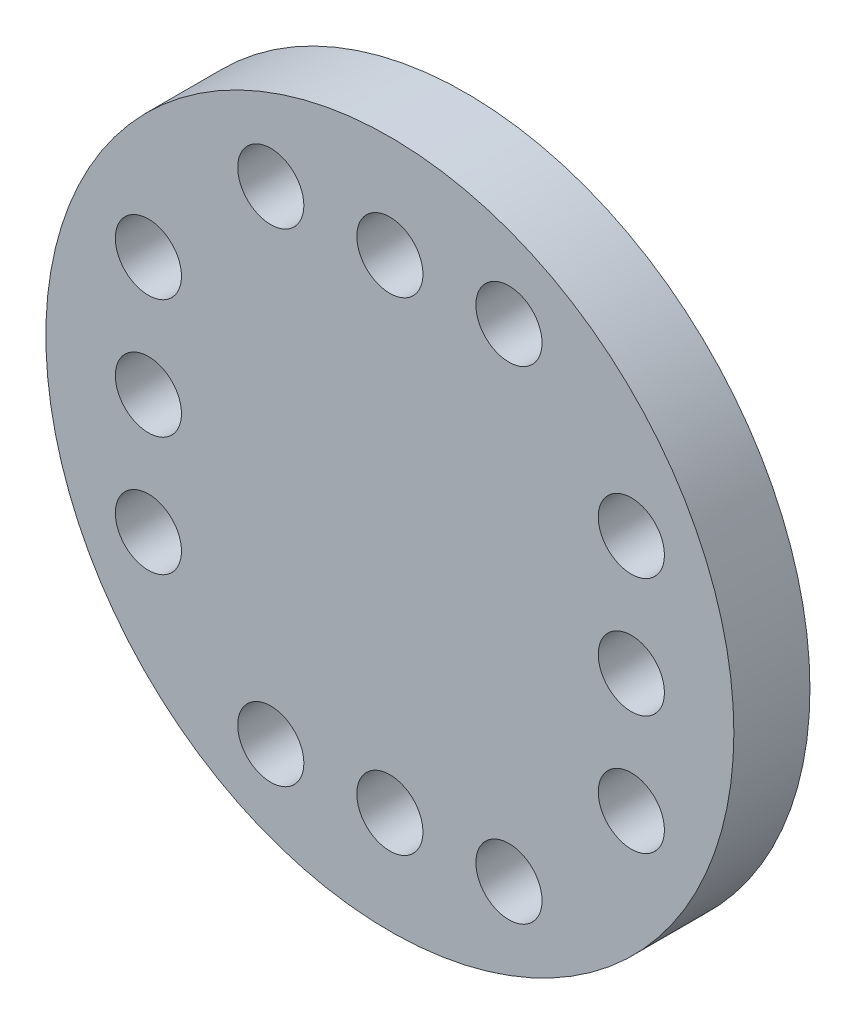
ISO-10303-21;
HEADER;
FILE_DESCRIPTION(('STEP AP214'),'2;1');
FILE_NAME('part.step','',(''),(''),'','','');
FILE_SCHEMA(('AUTOMOTIVE_DESIGN { 1 0 10303 214 1 1 1 1 }'));
ENDSEC;
DATA;
#1=APPLICATION_CONTEXT('core data for automotive mechanical design processes');
#2=APPLICATION_PROTOCOL_DEFINITION('international standard','automotive_design',2000,#1);
#3=PRODUCT_CONTEXT('',#1,'mechanical');
#4=PRODUCT('Part','Part','',(#3));
#5=PRODUCT_RELATED_PRODUCT_CATEGORY('part','',(#4));
#6=PRODUCT_DEFINITION_FORMATION('','',#4);
#7=PRODUCT_DEFINITION_CONTEXT('part definition',#1,'design');
#8=PRODUCT_DEFINITION('design','',#6,#7);
#9=PRODUCT_DEFINITION_SHAPE('','',#8);
#10=(LENGTH_UNIT() NAMED_UNIT(*) SI_UNIT(.MILLI.,.METRE.));
#11=(NAMED_UNIT(*) PLANE_ANGLE_UNIT() SI_UNIT($,.RADIAN.));
#12=(NAMED_UNIT(*) SI_UNIT($,.STERADIAN.) SOLID_ANGLE_UNIT());
#13=UNCERTAINTY_MEASURE_WITH_UNIT(LENGTH_MEASURE(1.E-05),#10,'distance_accuracy_value','');
#14=(GEOMETRIC_REPRESENTATION_CONTEXT(3) GLOBAL_UNCERTAINTY_ASSIGNED_CONTEXT((#13)) GLOBAL_UNIT_ASSIGNED_CONTEXT((#10,
#11,#12)) REPRESENTATION_CONTEXT('',''));
#15=CARTESIAN_POINT('',(0.,0.,0.));
#16=DIRECTION('',(0.,0.,1.));
#17=DIRECTION('',(1.,0.,0.));
#18=AXIS2_PLACEMENT_3D('',#15,#16,#17);
#19=CARTESIAN_POINT('',(10.45,0.,-3.));
#20=DIRECTION('',(0.,0.,1.));
#21=DIRECTION('',(1.,0.,0.));
#22=AXIS2_PLACEMENT_3D('',#19,#20,#21);
#23=PLANE('',#22);
#24=CARTESIAN_POINT('',(10.45,0.,-3.));
#25=DIRECTION('',(0.,0.,1.));
#26=DIRECTION('',(1.,0.,0.));
#27=AXIS2_PLACEMENT_3D('',#24,#25,#26);
#28=CIRCLE('',#27,4.4);
#29=CARTESIAN_POINT('',(14.85,0.,-3.));
#30=VERTEX_POINT('',#29);
#31=EDGE_CURVE('E34',#30,#30,#28,.T.);
#32=ORIENTED_EDGE('',*,*,#31,.F.);
#33=EDGE_LOOP('',(#32));
#34=FACE_BOUND('',#33,.T.);
#35=CARTESIAN_POINT('',(10.45,0.,-3.));
#36=DIRECTION('',(0.,0.,1.));
#37=DIRECTION('',(1.,0.,0.));
#38=AXIS2_PLACEMENT_3D('',#35,#36,#37);
#39=CIRCLE('',#38,2.95);
#40=CARTESIAN_POINT('',(13.4,0.,-3.));
#41=VERTEX_POINT('',#40);
#42=EDGE_CURVE('E41',#41,#41,#39,.T.);
#43=ORIENTED_EDGE('',*,*,#42,.T.);
#44=EDGE_LOOP('',(#43));
#45=FACE_BOUND('',#44,.T.);
#46=ADVANCED_FACE('F30',(#34,#45),#23,.F.);
#47=CARTESIAN_POINT('',(10.45,0.,0.));
#48=DIRECTION('',(0.,0.,-1.));
#49=DIRECTION('',(-1.,0.,0.));
#50=AXIS2_PLACEMENT_3D('',#47,#48,#49);
#51=CYLINDRICAL_SURFACE('',#50,4.4);
#52=CARTESIAN_POINT('',(10.45,0.,0.));
#53=DIRECTION('',(0.,0.,1.));
#54=DIRECTION('',(1.,0.,0.));
#55=AXIS2_PLACEMENT_3D('',#52,#53,#54);
#56=CIRCLE('',#55,4.4);
#57=CARTESIAN_POINT('',(14.85,0.,0.));
#58=VERTEX_POINT('',#57);
#59=EDGE_CURVE('E10',#58,#58,#56,.T.);
#60=ORIENTED_EDGE('',*,*,#59,.F.);
#61=EDGE_LOOP('',(#60));
#62=FACE_BOUND('',#61,.T.);
#63=ORIENTED_EDGE('',*,*,#31,.T.);
#64=EDGE_LOOP('',(#63));
#65=FACE_BOUND('',#64,.T.);
#66=ADVANCED_FACE('F32',(#62,#65),#51,.T.);
#67=CARTESIAN_POINT('',(10.45,0.,0.));
#68=DIRECTION('',(0.,0.,-1.));
#69=DIRECTION('',(-1.,0.,0.));
#70=AXIS2_PLACEMENT_3D('',#67,#68,#69);
#71=CYLINDRICAL_SURFACE('',#70,2.95);
#72=CARTESIAN_POINT('',(10.45,0.,0.));
#73=DIRECTION('',(0.,0.,1.));
#74=DIRECTION('',(1.,0.,0.));
#75=AXIS2_PLACEMENT_3D('',#72,#73,#74);
#76=CIRCLE('',#75,2.95);
#77=CARTESIAN_POINT('',(13.4,0.,0.));
#78=VERTEX_POINT('',#77);
#79=EDGE_CURVE('E45',#78,#78,#76,.T.);
#80=ORIENTED_EDGE('',*,*,#79,.T.);
#81=EDGE_LOOP('',(#80));
#82=FACE_BOUND('',#81,.T.);
#83=ORIENTED_EDGE('',*,*,#42,.F.);
#84=EDGE_LOOP('',(#83));
#85=FACE_BOUND('',#84,.T.);
#86=ADVANCED_FACE('F178',(#82,#85),#71,.F.);
#87=CARTESIAN_POINT('',(10.45,0.,0.));
#88=DIRECTION('',(0.,0.,1.));
#89=DIRECTION('',(1.,0.,0.));
#90=AXIS2_PLACEMENT_3D('',#87,#88,#89);
#91=PLANE('',#90);
#92=ORIENTED_EDGE('',*,*,#79,.F.);
#93=EDGE_LOOP('',(#92));
#94=FACE_BOUND('',#93,.T.);
#95=ADVANCED_FACE('F173',(#94),#91,.F.);
#96=CARTESIAN_POINT('',(17.75,3.60000000000019,0.));
#97=DIRECTION('',(0.,0.,1.));
#98=DIRECTION('',(1.,0.,0.));
#99=AXIS2_PLACEMENT_3D('',#96,#97,#98);
#100=CIRCLE('',#99,1.);
#101=CARTESIAN_POINT('',(18.75,3.60000000000019,0.));
#102=VERTEX_POINT('',#101);
#103=EDGE_CURVE('E118',#102,#102,#100,.T.);
#104=ORIENTED_EDGE('',*,*,#103,.T.);
#105=EDGE_LOOP('',(#104));
#106=FACE_BOUND('',#105,.T.);
#107=CARTESIAN_POINT('',(17.7500000000002,-3.59999999999981,0.));
#108=DIRECTION('',(0.,0.,1.));
#109=DIRECTION('',(1.,0.,0.));
#110=AXIS2_PLACEMENT_3D('',#107,#108,#109);
#111=CIRCLE('',#110,0.999999999999998);
#112=CARTESIAN_POINT('',(18.7500000000001,-3.59999999999981,0.));
#113=VERTEX_POINT('',#112);
#114=EDGE_CURVE('E112',#113,#113,#111,.T.);
#115=ORIENTED_EDGE('',*,*,#114,.T.);
#116=EDGE_LOOP('',(#115));
#117=FACE_BOUND('',#116,.T.);
#118=CARTESIAN_POINT('',(17.7500000000001,1.94289029309402E-13,0.));
#119=DIRECTION('',(0.,0.,1.));
#120=DIRECTION('',(1.,0.,0.));
#121=AXIS2_PLACEMENT_3D('',#118,#119,#120);
#122=CIRCLE('',#121,1.);
#123=CARTESIAN_POINT('',(18.7500000000001,1.94289029309402E-13,0.));
#124=VERTEX_POINT('',#123);
#125=EDGE_CURVE('E106',#124,#124,#122,.T.);
#126=ORIENTED_EDGE('',*,*,#125,.T.);
#127=EDGE_LOOP('',(#126));
#128=FACE_BOUND('',#127,.T.);
#129=CARTESIAN_POINT('',(14.0500000000003,-7.29999999999994,0.));
#130=DIRECTION('',(0.,0.,1.));
#131=DIRECTION('',(1.,0.,0.));
#132=AXIS2_PLACEMENT_3D('',#129,#130,#131);
#133=CIRCLE('',#132,1.);
#134=CARTESIAN_POINT('',(15.0500000000003,-7.29999999999994,0.));
#135=VERTEX_POINT('',#134);
#136=EDGE_CURVE('E100',#135,#135,#133,.T.);
#137=ORIENTED_EDGE('',*,*,#136,.T.);
#138=EDGE_LOOP('',(#137));
#139=FACE_BOUND('',#138,.T.);
#140=CARTESIAN_POINT('',(6.85000000000026,-7.30000000000001,0.));
#141=DIRECTION('',(0.,0.,1.));
#142=DIRECTION('',(1.,0.,0.));
#143=AXIS2_PLACEMENT_3D('',#140,#141,#142);
#144=CIRCLE('',#143,0.999999999999997);
#145=CARTESIAN_POINT('',(7.85000000000026,-7.30000000000001,0.));
#146=VERTEX_POINT('',#145);
#147=EDGE_CURVE('E94',#146,#146,#144,.T.);
#148=ORIENTED_EDGE('',*,*,#147,.T.);
#149=EDGE_LOOP('',(#148));
#150=FACE_BOUND('',#149,.T.);
#151=CARTESIAN_POINT('',(10.4500000000003,-7.29999999999999,0.));
#152=DIRECTION('',(0.,0.,1.));
#153=DIRECTION('',(1.,0.,0.));
#154=AXIS2_PLACEMENT_3D('',#151,#152,#153);
#155=CIRCLE('',#154,0.999999999999998);
#156=CARTESIAN_POINT('',(11.4500000000003,-7.29999999999999,0.));
#157=VERTEX_POINT('',#156);
#158=EDGE_CURVE('E88',#157,#157,#155,.T.);
#159=ORIENTED_EDGE('',*,*,#158,.T.);
#160=EDGE_LOOP('',(#159));
#161=FACE_BOUND('',#160,.T.);
#162=CARTESIAN_POINT('',(3.15000000000015,-3.60000000000011,0.));
#163=DIRECTION('',(0.,0.,1.));
#164=DIRECTION('',(1.,0.,0.));
#165=AXIS2_PLACEMENT_3D('',#162,#163,#164);
#166=CIRCLE('',#165,0.999999999999999);
#167=CARTESIAN_POINT('',(4.15000000000015,-3.60000000000011,0.));
#168=VERTEX_POINT('',#167);
#169=EDGE_CURVE('E82',#168,#168,#166,.T.);
#170=ORIENTED_EDGE('',*,*,#169,.T.);
#171=EDGE_LOOP('',(#170));
#172=FACE_BOUND('',#171,.T.);
#173=CARTESIAN_POINT('',(3.1500000000001,3.59999999999989,0.));
#174=DIRECTION('',(0.,0.,1.));
#175=DIRECTION('',(1.,0.,0.));
#176=AXIS2_PLACEMENT_3D('',#173,#174,#175);
#177=CIRCLE('',#176,0.999999999999999);
#178=CARTESIAN_POINT('',(4.1500000000001,3.59999999999989,0.));
#179=VERTEX_POINT('',#178);
#180=EDGE_CURVE('E76',#179,#179,#177,.T.);
#181=ORIENTED_EDGE('',*,*,#180,.T.);
#182=EDGE_LOOP('',(#181));
#183=FACE_BOUND('',#182,.T.);
#184=CARTESIAN_POINT('',(3.15000000000011,-1.14491749414469E-13,0.));
#185=DIRECTION('',(0.,0.,1.));
#186=DIRECTION('',(1.,0.,0.));
#187=AXIS2_PLACEMENT_3D('',#184,#185,#186);
#188=CIRCLE('',#187,1.);
#189=CARTESIAN_POINT('',(4.15000000000011,-1.14491749414469E-13,0.));
#190=VERTEX_POINT('',#189);
#191=EDGE_CURVE('E70',#190,#190,#188,.T.);
#192=ORIENTED_EDGE('',*,*,#191,.T.);
#193=EDGE_LOOP('',(#192));
#194=FACE_BOUND('',#193,.T.);
#195=CARTESIAN_POINT('',(6.85000000000001,7.29999999999999,0.));
#196=DIRECTION('',(0.,0.,1.));
#197=DIRECTION('',(1.,0.,0.));
#198=AXIS2_PLACEMENT_3D('',#195,#196,#197);
#199=CIRCLE('',#198,1.);
#200=CARTESIAN_POINT('',(7.85000000000001,7.29999999999999,0.));
#201=VERTEX_POINT('',#200);
#202=EDGE_CURVE('E64',#201,#201,#199,.T.);
#203=ORIENTED_EDGE('',*,*,#202,.T.);
#204=EDGE_LOOP('',(#203));
#205=FACE_BOUND('',#204,.T.);
#206=CARTESIAN_POINT('',(14.05,7.30000000000001,0.));
#207=DIRECTION('',(0.,0.,1.));
#208=DIRECTION('',(1.,0.,0.));
#209=AXIS2_PLACEMENT_3D('',#206,#207,#208);
#210=CIRCLE('',#209,0.999999999999998);
#211=CARTESIAN_POINT('',(15.05,7.30000000000001,0.));
#212=VERTEX_POINT('',#211);
#213=EDGE_CURVE('E58',#212,#212,#210,.T.);
#214=ORIENTED_EDGE('',*,*,#213,.T.);
#215=EDGE_LOOP('',(#214));
#216=FACE_BOUND('',#215,.T.);
#217=CARTESIAN_POINT('',(10.45,7.30000000000001,0.));
#218=DIRECTION('',(0.,0.,1.));
#219=DIRECTION('',(1.,0.,0.));
#220=AXIS2_PLACEMENT_3D('',#217,#218,#219);
#221=CIRCLE('',#220,1.);
#222=CARTESIAN_POINT('',(11.45,7.30000000000001,0.));
#223=VERTEX_POINT('',#222);
#224=EDGE_CURVE('E52',#223,#223,#221,.T.);
#225=ORIENTED_EDGE('',*,*,#224,.T.);
#226=EDGE_LOOP('',(#225));
#227=FACE_BOUND('',#226,.T.);
#228=CARTESIAN_POINT('',(10.45,0.,0.));
#229=DIRECTION('',(0.,0.,1.));
#230=DIRECTION('',(1.,0.,0.));
#231=AXIS2_PLACEMENT_3D('',#228,#229,#230);
#232=CIRCLE('',#231,10.4);
#233=CARTESIAN_POINT('',(20.85,0.,0.));
#234=VERTEX_POINT('',#233);
#235=EDGE_CURVE('E49',#234,#234,#232,.T.);
#236=ORIENTED_EDGE('',*,*,#235,.F.);
#237=EDGE_LOOP('',(#236));
#238=FACE_BOUND('',#237,.T.);
#239=ORIENTED_EDGE('',*,*,#59,.T.);
#240=EDGE_LOOP('',(#239));
#241=FACE_BOUND('',#240,.T.);
#242=ADVANCED_FACE('F127',(#106,#117,#128,#139,#150,#161,#172,#183,#194,#205,#216,#227,#238,
#241),#91,.F.);
#243=CARTESIAN_POINT('',(10.45,0.,2.3));
#244=DIRECTION('',(0.,0.,-1.));
#245=DIRECTION('',(-1.,0.,0.));
#246=AXIS2_PLACEMENT_3D('',#243,#244,#245);
#247=CYLINDRICAL_SURFACE('',#246,10.4);
#248=CARTESIAN_POINT('',(10.45,0.,2.3));
#249=DIRECTION('',(0.,0.,1.));
#250=DIRECTION('',(1.,0.,0.));
#251=AXIS2_PLACEMENT_3D('',#248,#249,#250);
#252=CIRCLE('',#251,10.4);
#253=CARTESIAN_POINT('',(20.85,0.,2.3));
#254=VERTEX_POINT('',#253);
#255=EDGE_CURVE('E48',#254,#254,#252,.T.);
#256=ORIENTED_EDGE('',*,*,#255,.F.);
#257=EDGE_LOOP('',(#256));
#258=FACE_BOUND('',#257,.T.);
#259=ORIENTED_EDGE('',*,*,#235,.T.);
#260=EDGE_LOOP('',(#259));
#261=FACE_BOUND('',#260,.T.);
#262=ADVANCED_FACE('F141',(#258,#261),#247,.T.);
#263=CARTESIAN_POINT('',(10.45,0.,2.3));
#264=DIRECTION('',(0.,0.,1.));
#265=DIRECTION('',(1.,0.,0.));
#266=AXIS2_PLACEMENT_3D('',#263,#264,#265);
#267=PLANE('',#266);
#268=CARTESIAN_POINT('',(17.75,3.60000000000019,2.3));
#269=DIRECTION('',(0.,0.,1.));
#270=DIRECTION('',(1.,0.,0.));
#271=AXIS2_PLACEMENT_3D('',#268,#269,#270);
#272=CIRCLE('',#271,1.);
#273=CARTESIAN_POINT('',(18.75,3.60000000000019,2.3));
#274=VERTEX_POINT('',#273);
#275=EDGE_CURVE('E121',#274,#274,#272,.T.);
#276=ORIENTED_EDGE('',*,*,#275,.F.);
#277=EDGE_LOOP('',(#276));
#278=FACE_BOUND('',#277,.T.);
#279=CARTESIAN_POINT('',(17.7500000000002,-3.59999999999981,2.3));
#280=DIRECTION('',(0.,0.,1.));
#281=DIRECTION('',(1.,0.,0.));
#282=AXIS2_PLACEMENT_3D('',#279,#280,#281);
#283=CIRCLE('',#282,0.999999999999998);
#284=CARTESIAN_POINT('',(18.7500000000001,-3.59999999999981,2.3));
#285=VERTEX_POINT('',#284);
#286=EDGE_CURVE('E115',#285,#285,#283,.T.);
#287=ORIENTED_EDGE('',*,*,#286,.F.);
#288=EDGE_LOOP('',(#287));
#289=FACE_BOUND('',#288,.T.);
#290=CARTESIAN_POINT('',(17.7500000000001,1.94289029309402E-13,2.3));
#291=DIRECTION('',(0.,0.,1.));
#292=DIRECTION('',(1.,0.,0.));
#293=AXIS2_PLACEMENT_3D('',#290,#291,#292);
#294=CIRCLE('',#293,1.);
#295=CARTESIAN_POINT('',(18.7500000000001,1.94289029309402E-13,2.3));
#296=VERTEX_POINT('',#295);
#297=EDGE_CURVE('E109',#296,#296,#294,.T.);
#298=ORIENTED_EDGE('',*,*,#297,.F.);
#299=EDGE_LOOP('',(#298));
#300=FACE_BOUND('',#299,.T.);
#301=CARTESIAN_POINT('',(14.0500000000003,-7.29999999999994,2.3));
#302=DIRECTION('',(0.,0.,1.));
#303=DIRECTION('',(1.,0.,0.));
#304=AXIS2_PLACEMENT_3D('',#301,#302,#303);
#305=CIRCLE('',#304,1.);
#306=CARTESIAN_POINT('',(15.0500000000003,-7.29999999999994,2.3));
#307=VERTEX_POINT('',#306);
#308=EDGE_CURVE('E103',#307,#307,#305,.T.);
#309=ORIENTED_EDGE('',*,*,#308,.F.);
#310=EDGE_LOOP('',(#309));
#311=FACE_BOUND('',#310,.T.);
#312=CARTESIAN_POINT('',(6.85000000000026,-7.30000000000001,2.3));
#313=DIRECTION('',(0.,0.,1.));
#314=DIRECTION('',(1.,0.,0.));
#315=AXIS2_PLACEMENT_3D('',#312,#313,#314);
#316=CIRCLE('',#315,0.999999999999997);
#317=CARTESIAN_POINT('',(7.85000000000026,-7.30000000000001,2.3));
#318=VERTEX_POINT('',#317);
#319=EDGE_CURVE('E97',#318,#318,#316,.T.);
#320=ORIENTED_EDGE('',*,*,#319,.F.);
#321=EDGE_LOOP('',(#320));
#322=FACE_BOUND('',#321,.T.);
#323=CARTESIAN_POINT('',(10.4500000000003,-7.29999999999999,2.3));
#324=DIRECTION('',(0.,0.,1.));
#325=DIRECTION('',(1.,0.,0.));
#326=AXIS2_PLACEMENT_3D('',#323,#324,#325);
#327=CIRCLE('',#326,0.999999999999998);
#328=CARTESIAN_POINT('',(11.4500000000003,-7.29999999999999,2.3));
#329=VERTEX_POINT('',#328);
#330=EDGE_CURVE('E91',#329,#329,#327,.T.);
#331=ORIENTED_EDGE('',*,*,#330,.F.);
#332=EDGE_LOOP('',(#331));
#333=FACE_BOUND('',#332,.T.);
#334=CARTESIAN_POINT('',(3.15000000000015,-3.60000000000011,2.3));
#335=DIRECTION('',(0.,0.,1.));
#336=DIRECTION('',(1.,0.,0.));
#337=AXIS2_PLACEMENT_3D('',#334,#335,#336);
#338=CIRCLE('',#337,0.999999999999999);
#339=CARTESIAN_POINT('',(4.15000000000015,-3.60000000000011,2.3));
#340=VERTEX_POINT('',#339);
#341=EDGE_CURVE('E85',#340,#340,#338,.T.);
#342=ORIENTED_EDGE('',*,*,#341,.F.);
#343=EDGE_LOOP('',(#342));
#344=FACE_BOUND('',#343,.T.);
#345=CARTESIAN_POINT('',(3.1500000000001,3.59999999999989,2.3));
#346=DIRECTION('',(0.,0.,1.));
#347=DIRECTION('',(1.,0.,0.));
#348=AXIS2_PLACEMENT_3D('',#345,#346,#347);
#349=CIRCLE('',#348,0.999999999999999);
#350=CARTESIAN_POINT('',(4.1500000000001,3.59999999999989,2.3));
#351=VERTEX_POINT('',#350);
#352=EDGE_CURVE('E79',#351,#351,#349,.T.);
#353=ORIENTED_EDGE('',*,*,#352,.F.);
#354=EDGE_LOOP('',(#353));
#355=FACE_BOUND('',#354,.T.);
#356=CARTESIAN_POINT('',(3.15000000000011,-1.14491749414469E-13,2.3));
#357=DIRECTION('',(0.,0.,1.));
#358=DIRECTION('',(1.,0.,0.));
#359=AXIS2_PLACEMENT_3D('',#356,#357,#358);
#360=CIRCLE('',#359,1.);
#361=CARTESIAN_POINT('',(4.15000000000011,-1.14491749414469E-13,2.3));
#362=VERTEX_POINT('',#361);
#363=EDGE_CURVE('E73',#362,#362,#360,.T.);
#364=ORIENTED_EDGE('',*,*,#363,.F.);
#365=EDGE_LOOP('',(#364));
#366=FACE_BOUND('',#365,.T.);
#367=CARTESIAN_POINT('',(6.85000000000001,7.29999999999999,2.3));
#368=DIRECTION('',(0.,0.,1.));
#369=DIRECTION('',(1.,0.,0.));
#370=AXIS2_PLACEMENT_3D('',#367,#368,#369);
#371=CIRCLE('',#370,1.);
#372=CARTESIAN_POINT('',(7.85000000000001,7.29999999999999,2.3));
#373=VERTEX_POINT('',#372);
#374=EDGE_CURVE('E67',#373,#373,#371,.T.);
#375=ORIENTED_EDGE('',*,*,#374,.F.);
#376=EDGE_LOOP('',(#375));
#377=FACE_BOUND('',#376,.T.);
#378=CARTESIAN_POINT('',(14.05,7.30000000000001,2.3));
#379=DIRECTION('',(0.,0.,1.));
#380=DIRECTION('',(1.,0.,0.));
#381=AXIS2_PLACEMENT_3D('',#378,#379,#380);
#382=CIRCLE('',#381,0.999999999999998);
#383=CARTESIAN_POINT('',(15.05,7.30000000000001,2.3));
#384=VERTEX_POINT('',#383);
#385=EDGE_CURVE('E61',#384,#384,#382,.T.);
#386=ORIENTED_EDGE('',*,*,#385,.F.);
#387=EDGE_LOOP('',(#386));
#388=FACE_BOUND('',#387,.T.);
#389=CARTESIAN_POINT('',(10.45,7.30000000000001,2.3));
#390=DIRECTION('',(0.,0.,1.));
#391=DIRECTION('',(1.,0.,0.));
#392=AXIS2_PLACEMENT_3D('',#389,#390,#391);
#393=CIRCLE('',#392,1.);
#394=CARTESIAN_POINT('',(11.45,7.30000000000001,2.3));
#395=VERTEX_POINT('',#394);
#396=EDGE_CURVE('E55',#395,#395,#393,.T.);
#397=ORIENTED_EDGE('',*,*,#396,.F.);
#398=EDGE_LOOP('',(#397));
#399=FACE_BOUND('',#398,.T.);
#400=ORIENTED_EDGE('',*,*,#255,.T.);
#401=EDGE_LOOP('',(#400));
#402=FACE_BOUND('',#401,.T.);
#403=ADVANCED_FACE('F137',(#278,#289,#300,#311,#322,#333,#344,#355,#366,#377,#388,#399,#402),
#267,.T.);
#404=CARTESIAN_POINT('',(10.45,7.30000000000001,0.));
#405=DIRECTION('',(0.,0.,1.));
#406=DIRECTION('',(1.,0.,0.));
#407=AXIS2_PLACEMENT_3D('',#404,#405,#406);
#408=CYLINDRICAL_SURFACE('',#407,1.);
#409=ORIENTED_EDGE('',*,*,#224,.F.);
#410=EDGE_LOOP('',(#409));
#411=FACE_BOUND('',#410,.T.);
#412=ORIENTED_EDGE('',*,*,#396,.T.);
#413=EDGE_LOOP('',(#412));
#414=FACE_BOUND('',#413,.T.);
#415=ADVANCED_FACE('F140',(#411,#414),#408,.F.);
#416=CARTESIAN_POINT('',(14.05,7.30000000000001,0.));
#417=DIRECTION('',(0.,0.,1.));
#418=DIRECTION('',(1.,0.,0.));
#419=AXIS2_PLACEMENT_3D('',#416,#417,#418);
#420=CYLINDRICAL_SURFACE('',#419,0.999999999999998);
#421=ORIENTED_EDGE('',*,*,#213,.F.);
#422=EDGE_LOOP('',(#421));
#423=FACE_BOUND('',#422,.T.);
#424=ORIENTED_EDGE('',*,*,#385,.T.);
#425=EDGE_LOOP('',(#424));
#426=FACE_BOUND('',#425,.T.);
#427=ADVANCED_FACE('F227',(#423,#426),#420,.F.);
#428=CARTESIAN_POINT('',(6.85000000000001,7.29999999999999,0.));
#429=DIRECTION('',(0.,0.,1.));
#430=DIRECTION('',(1.,0.,0.));
#431=AXIS2_PLACEMENT_3D('',#428,#429,#430);
#432=CYLINDRICAL_SURFACE('',#431,1.);
#433=ORIENTED_EDGE('',*,*,#202,.F.);
#434=EDGE_LOOP('',(#433));
#435=FACE_BOUND('',#434,.T.);
#436=ORIENTED_EDGE('',*,*,#374,.T.);
#437=EDGE_LOOP('',(#436));
#438=FACE_BOUND('',#437,.T.);
#439=ADVANCED_FACE('F237',(#435,#438),#432,.F.);
#440=CARTESIAN_POINT('',(3.15000000000011,-1.14491749414469E-13,0.));
#441=DIRECTION('',(0.,0.,1.));
#442=DIRECTION('',(1.,0.,0.));
#443=AXIS2_PLACEMENT_3D('',#440,#441,#442);
#444=CYLINDRICAL_SURFACE('',#443,1.);
#445=ORIENTED_EDGE('',*,*,#191,.F.);
#446=EDGE_LOOP('',(#445));
#447=FACE_BOUND('',#446,.T.);
#448=ORIENTED_EDGE('',*,*,#363,.T.);
#449=EDGE_LOOP('',(#448));
#450=FACE_BOUND('',#449,.T.);
#451=ADVANCED_FACE('F247',(#447,#450),#444,.F.);
#452=CARTESIAN_POINT('',(3.1500000000001,3.59999999999989,0.));
#453=DIRECTION('',(0.,0.,1.));
#454=DIRECTION('',(1.,0.,0.));
#455=AXIS2_PLACEMENT_3D('',#452,#453,#454);
#456=CYLINDRICAL_SURFACE('',#455,0.999999999999999);
#457=ORIENTED_EDGE('',*,*,#180,.F.);
#458=EDGE_LOOP('',(#457));
#459=FACE_BOUND('',#458,.T.);
#460=ORIENTED_EDGE('',*,*,#352,.T.);
#461=EDGE_LOOP('',(#460));
#462=FACE_BOUND('',#461,.T.);
#463=ADVANCED_FACE('F257',(#459,#462),#456,.F.);
#464=CARTESIAN_POINT('',(3.15000000000015,-3.60000000000011,0.));
#465=DIRECTION('',(0.,0.,1.));
#466=DIRECTION('',(1.,0.,0.));
#467=AXIS2_PLACEMENT_3D('',#464,#465,#466);
#468=CYLINDRICAL_SURFACE('',#467,0.999999999999999);
#469=ORIENTED_EDGE('',*,*,#169,.F.);
#470=EDGE_LOOP('',(#469));
#471=FACE_BOUND('',#470,.T.);
#472=ORIENTED_EDGE('',*,*,#341,.T.);
#473=EDGE_LOOP('',(#472));
#474=FACE_BOUND('',#473,.T.);
#475=ADVANCED_FACE('F267',(#471,#474),#468,.F.);
#476=CARTESIAN_POINT('',(10.4500000000003,-7.29999999999999,0.));
#477=DIRECTION('',(0.,0.,1.));
#478=DIRECTION('',(1.,0.,0.));
#479=AXIS2_PLACEMENT_3D('',#476,#477,#478);
#480=CYLINDRICAL_SURFACE('',#479,0.999999999999998);
#481=ORIENTED_EDGE('',*,*,#158,.F.);
#482=EDGE_LOOP('',(#481));
#483=FACE_BOUND('',#482,.T.);
#484=ORIENTED_EDGE('',*,*,#330,.T.);
#485=EDGE_LOOP('',(#484));
#486=FACE_BOUND('',#485,.T.);
#487=ADVANCED_FACE('F277',(#483,#486),#480,.F.);
#488=CARTESIAN_POINT('',(6.85000000000026,-7.30000000000001,0.));
#489=DIRECTION('',(0.,0.,1.));
#490=DIRECTION('',(1.,0.,0.));
#491=AXIS2_PLACEMENT_3D('',#488,#489,#490);
#492=CYLINDRICAL_SURFACE('',#491,0.999999999999997);
#493=ORIENTED_EDGE('',*,*,#147,.F.);
#494=EDGE_LOOP('',(#493));
#495=FACE_BOUND('',#494,.T.);
#496=ORIENTED_EDGE('',*,*,#319,.T.);
#497=EDGE_LOOP('',(#496));
#498=FACE_BOUND('',#497,.T.);
#499=ADVANCED_FACE('F287',(#495,#498),#492,.F.);
#500=CARTESIAN_POINT('',(14.0500000000003,-7.29999999999994,0.));
#501=DIRECTION('',(0.,0.,1.));
#502=DIRECTION('',(1.,0.,0.));
#503=AXIS2_PLACEMENT_3D('',#500,#501,#502);
#504=CYLINDRICAL_SURFACE('',#503,1.);
#505=ORIENTED_EDGE('',*,*,#136,.F.);
#506=EDGE_LOOP('',(#505));
#507=FACE_BOUND('',#506,.T.);
#508=ORIENTED_EDGE('',*,*,#308,.T.);
#509=EDGE_LOOP('',(#508));
#510=FACE_BOUND('',#509,.T.);
#511=ADVANCED_FACE('F297',(#507,#510),#504,.F.);
#512=CARTESIAN_POINT('',(17.7500000000001,1.94289029309402E-13,0.));
#513=DIRECTION('',(0.,0.,1.));
#514=DIRECTION('',(1.,0.,0.));
#515=AXIS2_PLACEMENT_3D('',#512,#513,#514);
#516=CYLINDRICAL_SURFACE('',#515,1.);
#517=ORIENTED_EDGE('',*,*,#125,.F.);
#518=EDGE_LOOP('',(#517));
#519=FACE_BOUND('',#518,.T.);
#520=ORIENTED_EDGE('',*,*,#297,.T.);
#521=EDGE_LOOP('',(#520));
#522=FACE_BOUND('',#521,.T.);
#523=ADVANCED_FACE('F307',(#519,#522),#516,.F.);
#524=CARTESIAN_POINT('',(17.7500000000002,-3.59999999999981,0.));
#525=DIRECTION('',(0.,0.,1.));
#526=DIRECTION('',(1.,0.,0.));
#527=AXIS2_PLACEMENT_3D('',#524,#525,#526);
#528=CYLINDRICAL_SURFACE('',#527,0.999999999999998);
#529=ORIENTED_EDGE('',*,*,#114,.F.);
#530=EDGE_LOOP('',(#529));
#531=FACE_BOUND('',#530,.T.);
#532=ORIENTED_EDGE('',*,*,#286,.T.);
#533=EDGE_LOOP('',(#532));
#534=FACE_BOUND('',#533,.T.);
#535=ADVANCED_FACE('F133',(#531,#534),#528,.F.);
#536=CARTESIAN_POINT('',(17.75,3.60000000000019,0.));
#537=DIRECTION('',(0.,0.,1.));
#538=DIRECTION('',(1.,0.,0.));
#539=AXIS2_PLACEMENT_3D('',#536,#537,#538);
#540=CYLINDRICAL_SURFACE('',#539,1.);
#541=ORIENTED_EDGE('',*,*,#103,.F.);
#542=EDGE_LOOP('',(#541));
#543=FACE_BOUND('',#542,.T.);
#544=ORIENTED_EDGE('',*,*,#275,.T.);
#545=EDGE_LOOP('',(#544));
#546=FACE_BOUND('',#545,.T.);
#547=ADVANCED_FACE('F130',(#543,#546),#540,.F.);
#548=CLOSED_SHELL('',(#46,#66,#86,#95,#242,#262,#403,#415,#427,#439,#451,#463,#475,#487,#499,
#511,#523,#535,#547));
#549=MANIFOLD_SOLID_BREP('B2',#548);
#550=ADVANCED_BREP_SHAPE_REPRESENTATION('',(#18,#549),#14);
#551=SHAPE_DEFINITION_REPRESENTATION(#9,#550);
ENDSEC;
END-ISO-10303-21;
